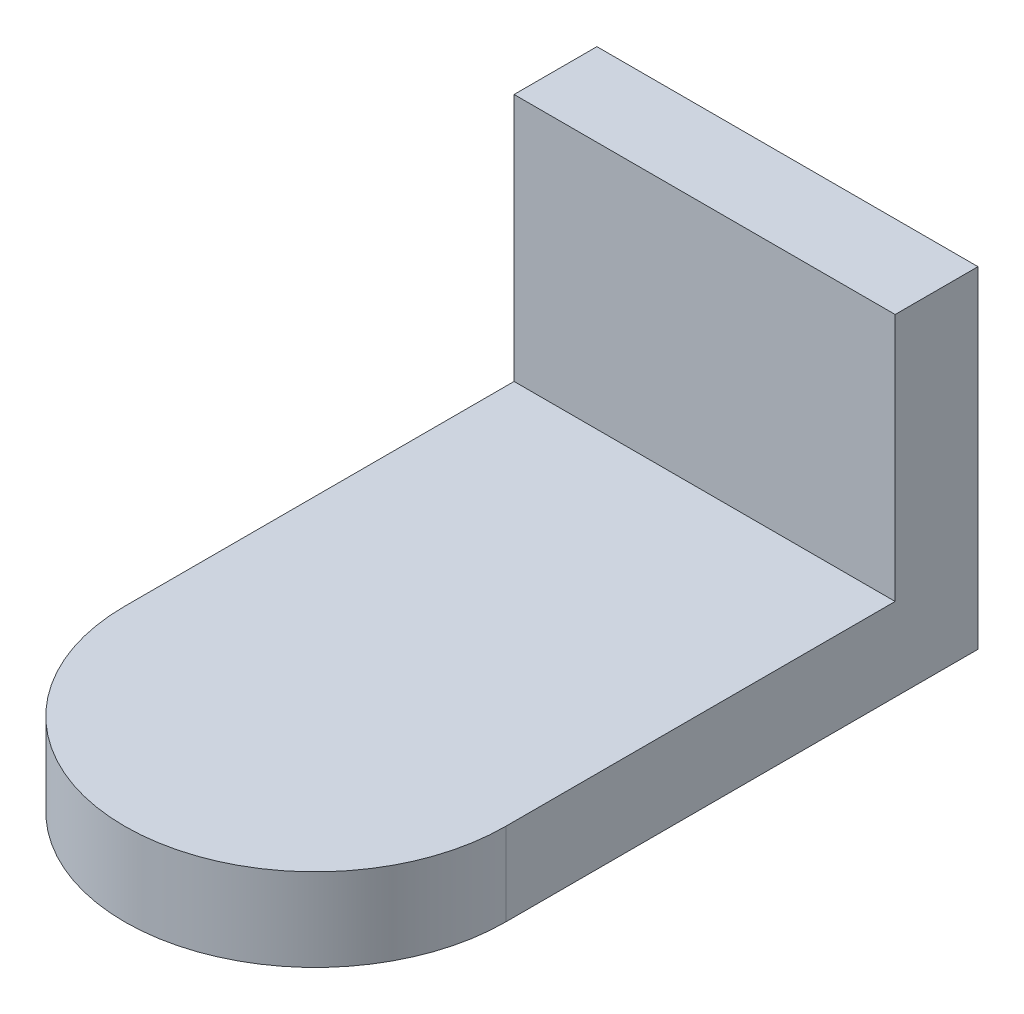
ISO-10303-21;
HEADER;
FILE_DESCRIPTION(('STEP AP214'),'2;1');
FILE_NAME('part.step','',(''),(''),'','','');
FILE_SCHEMA(('AUTOMOTIVE_DESIGN { 1 0 10303 214 1 1 1 1 }'));
ENDSEC;
DATA;
#1=APPLICATION_CONTEXT('core data for automotive mechanical design processes');
#2=APPLICATION_PROTOCOL_DEFINITION('international standard','automotive_design',2000,#1);
#3=PRODUCT_CONTEXT('',#1,'mechanical');
#4=PRODUCT('Part','Part','',(#3));
#5=PRODUCT_RELATED_PRODUCT_CATEGORY('part','',(#4));
#6=PRODUCT_DEFINITION_FORMATION('','',#4);
#7=PRODUCT_DEFINITION_CONTEXT('part definition',#1,'design');
#8=PRODUCT_DEFINITION('design','',#6,#7);
#9=PRODUCT_DEFINITION_SHAPE('','',#8);
#10=(LENGTH_UNIT() NAMED_UNIT(*) SI_UNIT(.MILLI.,.METRE.));
#11=(NAMED_UNIT(*) PLANE_ANGLE_UNIT() SI_UNIT($,.RADIAN.));
#12=(NAMED_UNIT(*) SI_UNIT($,.STERADIAN.) SOLID_ANGLE_UNIT());
#13=UNCERTAINTY_MEASURE_WITH_UNIT(LENGTH_MEASURE(1.E-05),#10,'distance_accuracy_value','');
#14=(GEOMETRIC_REPRESENTATION_CONTEXT(3) GLOBAL_UNCERTAINTY_ASSIGNED_CONTEXT((#13)) GLOBAL_UNIT_ASSIGNED_CONTEXT((#10,
#11,#12)) REPRESENTATION_CONTEXT('',''));
#15=CARTESIAN_POINT('',(0.,0.,0.));
#16=DIRECTION('',(0.,0.,1.));
#17=DIRECTION('',(1.,0.,0.));
#18=AXIS2_PLACEMENT_3D('',#15,#16,#17);
#19=CARTESIAN_POINT('',(0.,0.,-1.45));
#20=DIRECTION('',(0.,0.,1.));
#21=DIRECTION('',(-1.,0.,0.));
#22=AXIS2_PLACEMENT_3D('',#19,#20,#21);
#23=PLANE('',#22);
#24=DIRECTION('',(0.,1.,0.));
#25=VECTOR('',#24,1.);
#26=CARTESIAN_POINT('',(-0.135,-0.2,-1.45));
#27=LINE('',#26,#25);
#28=CARTESIAN_POINT('',(-0.135,-0.35,-1.45));
#29=VERTEX_POINT('',#28);
#30=CARTESIAN_POINT('',(-0.135,-0.2,-1.45));
#31=VERTEX_POINT('',#30);
#32=EDGE_CURVE('E11',#29,#31,#27,.T.);
#33=ORIENTED_EDGE('',*,*,#32,.T.);
#34=DIRECTION('',(-1.,0.,0.));
#35=VECTOR('',#34,1.);
#36=CARTESIAN_POINT('',(-0.365,-0.2,-1.45));
#37=LINE('',#36,#35);
#38=CARTESIAN_POINT('',(-0.365,-0.2,-1.45));
#39=VERTEX_POINT('',#38);
#40=EDGE_CURVE('E24',#31,#39,#37,.T.);
#41=ORIENTED_EDGE('',*,*,#40,.T.);
#42=DIRECTION('',(0.,-1.,0.));
#43=VECTOR('',#42,1.);
#44=CARTESIAN_POINT('',(-0.365,-0.2,-1.45));
#45=LINE('',#44,#43);
#46=CARTESIAN_POINT('',(-0.365,-0.35,-1.45));
#47=VERTEX_POINT('',#46);
#48=EDGE_CURVE('E117',#39,#47,#45,.T.);
#49=ORIENTED_EDGE('',*,*,#48,.T.);
#50=DIRECTION('',(-1.,0.,0.));
#51=VECTOR('',#50,1.);
#52=CARTESIAN_POINT('',(-0.365,-0.35,-1.45));
#53=LINE('',#52,#51);
#54=EDGE_CURVE('E85',#29,#47,#53,.T.);
#55=ORIENTED_EDGE('',*,*,#54,.F.);
#56=EDGE_LOOP('',(#33,#41,#49,#55));
#57=FACE_BOUND('',#56,.T.);
#58=ADVANCED_FACE('F17',(#57),#23,.T.);
#59=CARTESIAN_POINT('',(-0.365,-0.2,-1.45));
#60=DIRECTION('',(0.,1.,0.));
#61=DIRECTION('',(-1.,0.,0.));
#62=AXIS2_PLACEMENT_3D('',#59,#60,#61);
#63=PLANE('',#62);
#64=DIRECTION('',(-1.,0.,0.));
#65=VECTOR('',#64,1.);
#66=CARTESIAN_POINT('',(-0.365,-0.2,-1.5));
#67=LINE('',#66,#65);
#68=CARTESIAN_POINT('',(-0.135,-0.2,-1.5));
#69=VERTEX_POINT('',#68);
#70=CARTESIAN_POINT('',(-0.365,-0.2,-1.5));
#71=VERTEX_POINT('',#70);
#72=EDGE_CURVE('E114',#69,#71,#67,.T.);
#73=ORIENTED_EDGE('',*,*,#72,.T.);
#74=DIRECTION('',(0.,0.,-1.));
#75=VECTOR('',#74,1.);
#76=CARTESIAN_POINT('',(-0.365,-0.2,-1.45));
#77=LINE('',#76,#75);
#78=EDGE_CURVE('E111',#39,#71,#77,.T.);
#79=ORIENTED_EDGE('',*,*,#78,.F.);
#80=ORIENTED_EDGE('',*,*,#40,.F.);
#81=DIRECTION('',(0.,0.,-1.));
#82=VECTOR('',#81,1.);
#83=CARTESIAN_POINT('',(-0.135,-0.2,-1.45));
#84=LINE('',#83,#82);
#85=EDGE_CURVE('E108',#31,#69,#84,.T.);
#86=ORIENTED_EDGE('',*,*,#85,.T.);
#87=EDGE_LOOP('',(#73,#79,#80,#86));
#88=FACE_BOUND('',#87,.T.);
#89=ADVANCED_FACE('F121',(#88),#63,.T.);
#90=CARTESIAN_POINT('',(-0.135,-0.2,-1.45));
#91=DIRECTION('',(1.,0.,0.));
#92=DIRECTION('',(0.,0.,1.));
#93=AXIS2_PLACEMENT_3D('',#90,#91,#92);
#94=PLANE('',#93);
#95=DIRECTION('',(0.,1.,0.));
#96=VECTOR('',#95,1.);
#97=CARTESIAN_POINT('',(-0.135,-0.2,-1.5));
#98=LINE('',#97,#96);
#99=CARTESIAN_POINT('',(-0.135,-0.4,-1.5));
#100=VERTEX_POINT('',#99);
#101=EDGE_CURVE('E105',#100,#69,#98,.T.);
#102=ORIENTED_EDGE('',*,*,#101,.T.);
#103=ORIENTED_EDGE('',*,*,#85,.F.);
#104=ORIENTED_EDGE('',*,*,#32,.F.);
#105=DIRECTION('',(0.,0.,-1.));
#106=VECTOR('',#105,1.);
#107=CARTESIAN_POINT('',(-0.135,-0.35,-1.45));
#108=LINE('',#107,#106);
#109=CARTESIAN_POINT('',(-0.135,-0.35,-1.215));
#110=VERTEX_POINT('',#109);
#111=EDGE_CURVE('E103',#110,#29,#108,.T.);
#112=ORIENTED_EDGE('',*,*,#111,.F.);
#113=DIRECTION('',(0.,-1.,0.));
#114=VECTOR('',#113,1.);
#115=CARTESIAN_POINT('',(-0.135,-0.35,-1.215));
#116=LINE('',#115,#114);
#117=CARTESIAN_POINT('',(-0.135,-0.4,-1.215));
#118=VERTEX_POINT('',#117);
#119=EDGE_CURVE('E89',#110,#118,#116,.T.);
#120=ORIENTED_EDGE('',*,*,#119,.T.);
#121=DIRECTION('',(0.,0.,-1.));
#122=VECTOR('',#121,1.);
#123=CARTESIAN_POINT('',(-0.135,-0.4,-1.45));
#124=LINE('',#123,#122);
#125=EDGE_CURVE('E99',#118,#100,#124,.T.);
#126=ORIENTED_EDGE('',*,*,#125,.T.);
#127=EDGE_LOOP('',(#102,#103,#104,#112,#120,#126));
#128=FACE_BOUND('',#127,.T.);
#129=ADVANCED_FACE('F127',(#128),#94,.T.);
#130=CARTESIAN_POINT('',(-0.365,-0.4,-1.45));
#131=DIRECTION('',(0.,-1.,0.));
#132=DIRECTION('',(1.,0.,0.));
#133=AXIS2_PLACEMENT_3D('',#130,#131,#132);
#134=PLANE('',#133);
#135=DIRECTION('',(1.,0.,0.));
#136=VECTOR('',#135,1.);
#137=CARTESIAN_POINT('',(-0.365,-0.4,-1.5));
#138=LINE('',#137,#136);
#139=CARTESIAN_POINT('',(-0.365,-0.4,-1.5));
#140=VERTEX_POINT('',#139);
#141=EDGE_CURVE('E96',#140,#100,#138,.T.);
#142=ORIENTED_EDGE('',*,*,#141,.T.);
#143=ORIENTED_EDGE('',*,*,#125,.F.);
#144=CARTESIAN_POINT('',(-0.25,-0.4,-1.215));
#145=DIRECTION('',(0.,1.,0.));
#146=DIRECTION('',(1.,0.,0.));
#147=AXIS2_PLACEMENT_3D('',#144,#145,#146);
#148=CIRCLE('',#147,0.115);
#149=CARTESIAN_POINT('',(-0.365,-0.4,-1.215));
#150=VERTEX_POINT('',#149);
#151=EDGE_CURVE('E94',#150,#118,#148,.T.);
#152=ORIENTED_EDGE('',*,*,#151,.F.);
#153=DIRECTION('',(0.,0.,-1.));
#154=VECTOR('',#153,1.);
#155=CARTESIAN_POINT('',(-0.365,-0.4,-1.45));
#156=LINE('',#155,#154);
#157=EDGE_CURVE('E73',#150,#140,#156,.T.);
#158=ORIENTED_EDGE('',*,*,#157,.T.);
#159=EDGE_LOOP('',(#142,#143,#152,#158));
#160=FACE_BOUND('',#159,.T.);
#161=ADVANCED_FACE('F126',(#160),#134,.T.);
#162=CARTESIAN_POINT('',(-0.365,-0.2,-1.45));
#163=DIRECTION('',(-1.,0.,0.));
#164=DIRECTION('',(0.,0.,-1.));
#165=AXIS2_PLACEMENT_3D('',#162,#163,#164);
#166=PLANE('',#165);
#167=DIRECTION('',(0.,-1.,0.));
#168=VECTOR('',#167,1.);
#169=CARTESIAN_POINT('',(-0.365,-0.2,-1.5));
#170=LINE('',#169,#168);
#171=EDGE_CURVE('E77',#71,#140,#170,.T.);
#172=ORIENTED_EDGE('',*,*,#171,.T.);
#173=ORIENTED_EDGE('',*,*,#157,.F.);
#174=DIRECTION('',(0.,-1.,0.));
#175=VECTOR('',#174,1.);
#176=CARTESIAN_POINT('',(-0.365,-0.35,-1.215));
#177=LINE('',#176,#175);
#178=CARTESIAN_POINT('',(-0.365,-0.35,-1.215));
#179=VERTEX_POINT('',#178);
#180=EDGE_CURVE('E66',#179,#150,#177,.T.);
#181=ORIENTED_EDGE('',*,*,#180,.F.);
#182=DIRECTION('',(0.,0.,1.));
#183=VECTOR('',#182,1.);
#184=CARTESIAN_POINT('',(-0.365,-0.35,-1.45));
#185=LINE('',#184,#183);
#186=EDGE_CURVE('E71',#47,#179,#185,.T.);
#187=ORIENTED_EDGE('',*,*,#186,.F.);
#188=ORIENTED_EDGE('',*,*,#48,.F.);
#189=ORIENTED_EDGE('',*,*,#78,.T.);
#190=EDGE_LOOP('',(#172,#173,#181,#187,#188,#189));
#191=FACE_BOUND('',#190,.T.);
#192=ADVANCED_FACE('F69',(#191),#166,.T.);
#193=CARTESIAN_POINT('',(0.,0.,-1.5));
#194=DIRECTION('',(0.,0.,1.));
#195=DIRECTION('',(-1.,0.,0.));
#196=AXIS2_PLACEMENT_3D('',#193,#194,#195);
#197=PLANE('',#196);
#198=ORIENTED_EDGE('',*,*,#72,.F.);
#199=ORIENTED_EDGE('',*,*,#101,.F.);
#200=ORIENTED_EDGE('',*,*,#141,.F.);
#201=ORIENTED_EDGE('',*,*,#171,.F.);
#202=EDGE_LOOP('',(#198,#199,#200,#201));
#203=FACE_BOUND('',#202,.T.);
#204=ADVANCED_FACE('F123',(#203),#197,.F.);
#205=CARTESIAN_POINT('',(-0.25,-0.35,-1.215));
#206=DIRECTION('',(0.,-1.,0.));
#207=DIRECTION('',(1.,0.,0.));
#208=AXIS2_PLACEMENT_3D('',#205,#206,#207);
#209=CYLINDRICAL_SURFACE('',#208,0.115);
#210=ORIENTED_EDGE('',*,*,#151,.T.);
#211=ORIENTED_EDGE('',*,*,#119,.F.);
#212=CARTESIAN_POINT('',(-0.25,-0.35,-1.215));
#213=DIRECTION('',(0.,1.,0.));
#214=DIRECTION('',(1.,0.,0.));
#215=AXIS2_PLACEMENT_3D('',#212,#213,#214);
#216=CIRCLE('',#215,0.115);
#217=EDGE_CURVE('E84',#179,#110,#216,.T.);
#218=ORIENTED_EDGE('',*,*,#217,.F.);
#219=ORIENTED_EDGE('',*,*,#180,.T.);
#220=EDGE_LOOP('',(#210,#211,#218,#219));
#221=FACE_BOUND('',#220,.T.);
#222=ADVANCED_FACE('F88',(#221),#209,.T.);
#223=CARTESIAN_POINT('',(-0.25,-0.35,-1.215));
#224=DIRECTION('',(0.,-1.,0.));
#225=DIRECTION('',(1.,0.,0.));
#226=AXIS2_PLACEMENT_3D('',#223,#224,#225);
#227=PLANE('',#226);
#228=ORIENTED_EDGE('',*,*,#186,.T.);
#229=ORIENTED_EDGE('',*,*,#217,.T.);
#230=ORIENTED_EDGE('',*,*,#111,.T.);
#231=ORIENTED_EDGE('',*,*,#54,.T.);
#232=EDGE_LOOP('',(#228,#229,#230,#231));
#233=FACE_BOUND('',#232,.T.);
#234=ADVANCED_FACE('F82',(#233),#227,.F.);
#235=CLOSED_SHELL('',(#58,#89,#129,#161,#192,#204,#222,#234));
#236=MANIFOLD_SOLID_BREP('B1',#235);
#237=ADVANCED_BREP_SHAPE_REPRESENTATION('',(#18,#236),#14);
#238=SHAPE_DEFINITION_REPRESENTATION(#9,#237);
ENDSEC;
END-ISO-10303-21;
